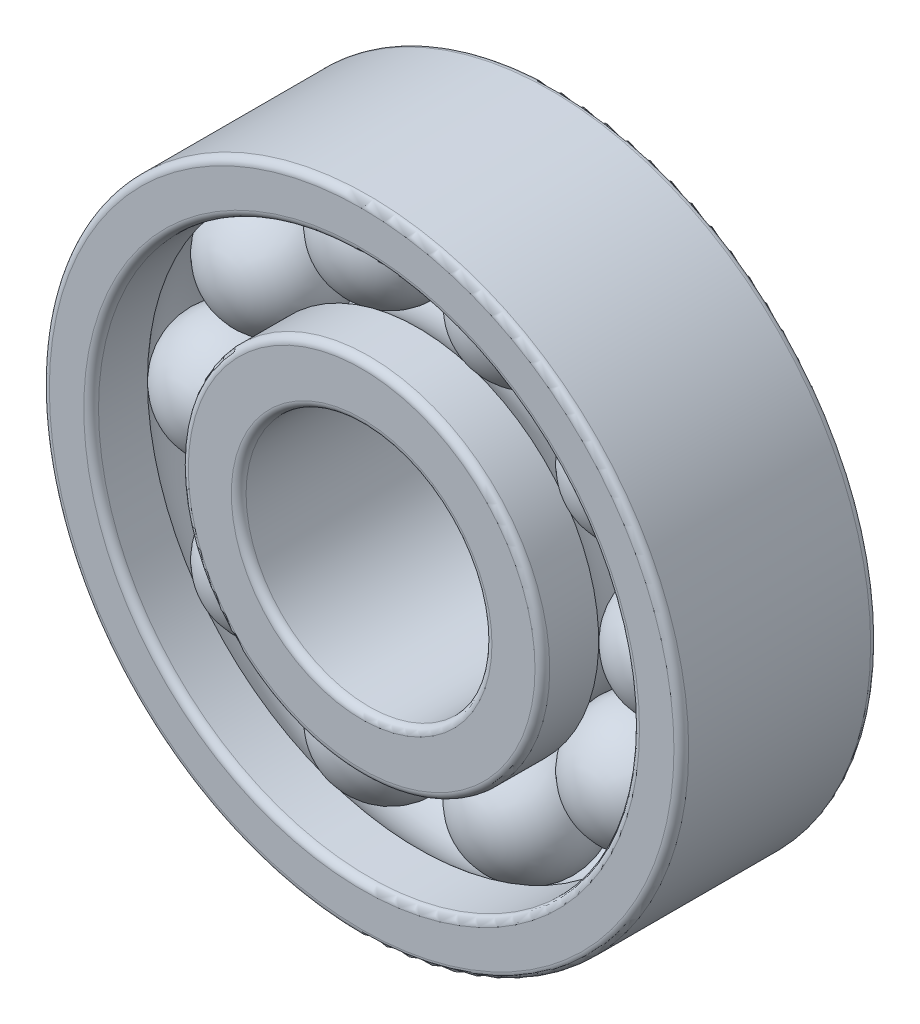
ISO-10303-21;
HEADER;
FILE_DESCRIPTION(('STEP AP214'),'2;1');
FILE_NAME('part.step','',(''),(''),'','','');
FILE_SCHEMA(('AUTOMOTIVE_DESIGN { 1 0 10303 214 1 1 1 1 }'));
ENDSEC;
DATA;
#1=APPLICATION_CONTEXT('core data for automotive mechanical design processes');
#2=APPLICATION_PROTOCOL_DEFINITION('international standard','automotive_design',2000,#1);
#3=PRODUCT_CONTEXT('',#1,'mechanical');
#4=PRODUCT('Part','Part','',(#3));
#5=PRODUCT_RELATED_PRODUCT_CATEGORY('part','',(#4));
#6=PRODUCT_DEFINITION_FORMATION('','',#4);
#7=PRODUCT_DEFINITION_CONTEXT('part definition',#1,'design');
#8=PRODUCT_DEFINITION('design','',#6,#7);
#9=PRODUCT_DEFINITION_SHAPE('','',#8);
#10=(LENGTH_UNIT() NAMED_UNIT(*) SI_UNIT(.MILLI.,.METRE.));
#11=(NAMED_UNIT(*) PLANE_ANGLE_UNIT() SI_UNIT($,.RADIAN.));
#12=(NAMED_UNIT(*) SI_UNIT($,.STERADIAN.) SOLID_ANGLE_UNIT());
#13=UNCERTAINTY_MEASURE_WITH_UNIT(LENGTH_MEASURE(1.E-05),#10,'distance_accuracy_value','');
#14=(GEOMETRIC_REPRESENTATION_CONTEXT(3) GLOBAL_UNCERTAINTY_ASSIGNED_CONTEXT((#13)) GLOBAL_UNIT_ASSIGNED_CONTEXT((#10,
#11,#12)) REPRESENTATION_CONTEXT('',''));
#15=CARTESIAN_POINT('',(0.,0.,0.));
#16=DIRECTION('',(0.,0.,1.));
#17=DIRECTION('',(1.,0.,0.));
#18=AXIS2_PLACEMENT_3D('',#15,#16,#17);
#19=CARTESIAN_POINT('',(-7.42273092339021,5.39292968978334,4.));
#20=DIRECTION('',(0.,0.,-1.));
#21=DIRECTION('',(0.809016994374955,-0.587785252292462,0.));
#22=AXIS2_PLACEMENT_3D('',#19,#20,#21);
#23=SPHERICAL_SURFACE('',#22,2.5);
#24=CARTESIAN_POINT('',(-7.42273092339021,5.39292968978334,1.5));
#25=VERTEX_POINT('',#24);
#26=VERTEX_LOOP('',#25);
#27=FACE_BOUND('',#26,.T.);
#28=ADVANCED_FACE('F73',(#27),#23,.T.);
#29=CLOSED_SHELL('',(#28));
#30=MANIFOLD_SOLID_BREP('B2',#29);
#31=CARTESIAN_POINT('',(-2.83523092339024,8.725943537008,4.));
#32=DIRECTION('',(0.,0.,-1.));
#33=DIRECTION('',(0.309016994374958,-0.95105651629515,0.));
#34=AXIS2_PLACEMENT_3D('',#31,#32,#33);
#35=SPHERICAL_SURFACE('',#34,2.5);
#36=CARTESIAN_POINT('',(-2.83523092339024,8.725943537008,1.5));
#37=VERTEX_POINT('',#36);
#38=VERTEX_LOOP('',#37);
#39=FACE_BOUND('',#38,.T.);
#40=ADVANCED_FACE('F91',(#39),#35,.T.);
#41=CLOSED_SHELL('',(#40));
#42=MANIFOLD_SOLID_BREP('B7',#41);
#43=CARTESIAN_POINT('',(2.83523092339006,8.72594353700806,4.));
#44=DIRECTION('',(0.,0.,-1.));
#45=DIRECTION('',(-0.309016994374938,-0.951056516295157,0.));
#46=AXIS2_PLACEMENT_3D('',#43,#44,#45);
#47=SPHERICAL_SURFACE('',#46,2.5);
#48=CARTESIAN_POINT('',(2.83523092339006,8.72594353700806,1.5));
#49=VERTEX_POINT('',#48);
#50=VERTEX_LOOP('',#49);
#51=FACE_BOUND('',#50,.T.);
#52=ADVANCED_FACE('F109',(#51),#47,.T.);
#53=CLOSED_SHELL('',(#52));
#54=MANIFOLD_SOLID_BREP('B69',#53);
#55=CARTESIAN_POINT('',(7.4227309233901,5.39292968978351,4.));
#56=DIRECTION('',(0.,0.,-1.));
#57=DIRECTION('',(-0.809016994374942,-0.58778525229248,0.));
#58=AXIS2_PLACEMENT_3D('',#55,#56,#57);
#59=SPHERICAL_SURFACE('',#58,2.5);
#60=CARTESIAN_POINT('',(7.4227309233901,5.39292968978351,1.5));
#61=VERTEX_POINT('',#60);
#62=VERTEX_LOOP('',#61);
#63=FACE_BOUND('',#62,.T.);
#64=ADVANCED_FACE('F127',(#63),#59,.T.);
#65=CLOSED_SHELL('',(#64));
#66=MANIFOLD_SOLID_BREP('B87',#65);
#67=CARTESIAN_POINT('',(9.175,0.,4.));
#68=DIRECTION('',(0.,0.,-1.));
#69=DIRECTION('',(-1.,0.,0.));
#70=AXIS2_PLACEMENT_3D('',#67,#68,#69);
#71=SPHERICAL_SURFACE('',#70,2.5);
#72=CARTESIAN_POINT('',(9.175,0.,1.5));
#73=VERTEX_POINT('',#72);
#74=VERTEX_LOOP('',#73);
#75=FACE_BOUND('',#74,.T.);
#76=ADVANCED_FACE('F145',(#75),#71,.T.);
#77=CLOSED_SHELL('',(#76));
#78=MANIFOLD_SOLID_BREP('B105',#77);
#79=CARTESIAN_POINT('',(7.42273092339017,-5.3929296897834,4.));
#80=DIRECTION('',(0.,0.,-1.));
#81=DIRECTION('',(-0.809016994374951,0.587785252292469,0.));
#82=AXIS2_PLACEMENT_3D('',#79,#80,#81);
#83=SPHERICAL_SURFACE('',#82,2.5);
#84=CARTESIAN_POINT('',(7.42273092339017,-5.3929296897834,1.5));
#85=VERTEX_POINT('',#84);
#86=VERTEX_LOOP('',#85);
#87=FACE_BOUND('',#86,.T.);
#88=ADVANCED_FACE('F163',(#87),#83,.T.);
#89=CLOSED_SHELL('',(#88));
#90=MANIFOLD_SOLID_BREP('B123',#89);
#91=CARTESIAN_POINT('',(2.83523092339018,-8.72594353700802,4.));
#92=DIRECTION('',(0.,0.,-1.));
#93=DIRECTION('',(-0.309016994374952,0.951056516295152,0.));
#94=AXIS2_PLACEMENT_3D('',#91,#92,#93);
#95=SPHERICAL_SURFACE('',#94,2.5);
#96=CARTESIAN_POINT('',(2.83523092339018,-8.72594353700802,1.5));
#97=VERTEX_POINT('',#96);
#98=VERTEX_LOOP('',#97);
#99=FACE_BOUND('',#98,.T.);
#100=ADVANCED_FACE('F181',(#99),#95,.T.);
#101=CLOSED_SHELL('',(#100));
#102=MANIFOLD_SOLID_BREP('B141',#101);
#103=CARTESIAN_POINT('',(-2.83523092339012,-8.72594353700804,4.));
#104=DIRECTION('',(0.,0.,-1.));
#105=DIRECTION('',(0.309016994374945,0.951056516295155,0.));
#106=AXIS2_PLACEMENT_3D('',#103,#104,#105);
#107=SPHERICAL_SURFACE('',#106,2.5);
#108=CARTESIAN_POINT('',(-2.83523092339012,-8.72594353700804,1.5));
#109=VERTEX_POINT('',#108);
#110=VERTEX_LOOP('',#109);
#111=FACE_BOUND('',#110,.T.);
#112=ADVANCED_FACE('F199',(#111),#107,.T.);
#113=CLOSED_SHELL('',(#112));
#114=MANIFOLD_SOLID_BREP('B159',#113);
#115=CARTESIAN_POINT('',(-7.42273092339014,-5.39292968978345,4.));
#116=DIRECTION('',(0.,0.,-1.));
#117=DIRECTION('',(0.809016994374947,0.587785252292474,0.));
#118=AXIS2_PLACEMENT_3D('',#115,#116,#117);
#119=SPHERICAL_SURFACE('',#118,2.5);
#120=CARTESIAN_POINT('',(-7.42273092339014,-5.39292968978345,1.5));
#121=VERTEX_POINT('',#120);
#122=VERTEX_LOOP('',#121);
#123=FACE_BOUND('',#122,.T.);
#124=ADVANCED_FACE('F217',(#123),#119,.T.);
#125=CLOSED_SHELL('',(#124));
#126=MANIFOLD_SOLID_BREP('B177',#125);
#127=CARTESIAN_POINT('',(-9.175,0.,4.));
#128=DIRECTION('',(0.,0.,-1.));
#129=DIRECTION('',(1.,0.,0.));
#130=AXIS2_PLACEMENT_3D('',#127,#128,#129);
#131=SPHERICAL_SURFACE('',#130,2.5);
#132=CARTESIAN_POINT('',(-9.175,0.,1.5));
#133=VERTEX_POINT('',#132);
#134=VERTEX_LOOP('',#133);
#135=FACE_BOUND('',#134,.T.);
#136=ADVANCED_FACE('F237',(#135),#131,.T.);
#137=CLOSED_SHELL('',(#136));
#138=MANIFOLD_SOLID_BREP('B195',#137);
#139=CARTESIAN_POINT('',(0.,0.,8.));
#140=DIRECTION('',(0.,0.,-1.));
#141=DIRECTION('',(-1.,0.,0.));
#142=AXIS2_PLACEMENT_3D('',#139,#140,#141);
#143=CYLINDRICAL_SURFACE('',#142,7.35);
#144=CARTESIAN_POINT('',(0.,0.,0.3));
#145=DIRECTION('',(0.,0.,1.));
#146=DIRECTION('',(1.,0.,0.));
#147=AXIS2_PLACEMENT_3D('',#144,#145,#146);
#148=CIRCLE('',#147,7.35);
#149=CARTESIAN_POINT('',(7.35,0.,0.3));
#150=VERTEX_POINT('',#149);
#151=EDGE_CURVE('E236',#150,#150,#148,.T.);
#152=ORIENTED_EDGE('',*,*,#151,.T.);
#153=EDGE_LOOP('',(#152));
#154=FACE_BOUND('',#153,.T.);
#155=CARTESIAN_POINT('',(0.,0.,2.29138213751582));
#156=DIRECTION('',(0.,0.,1.));
#157=DIRECTION('',(1.,0.,0.));
#158=AXIS2_PLACEMENT_3D('',#155,#156,#157);
#159=CIRCLE('',#158,7.35);
#160=CARTESIAN_POINT('',(7.35,0.,2.29138213751582));
#161=VERTEX_POINT('',#160);
#162=EDGE_CURVE('E288',#161,#161,#159,.F.);
#163=ORIENTED_EDGE('',*,*,#162,.T.);
#164=EDGE_LOOP('',(#163));
#165=FACE_BOUND('',#164,.T.);
#166=ADVANCED_FACE('F256',(#154,#165),#143,.T.);
#167=CARTESIAN_POINT('',(0.,0.,8.));
#168=DIRECTION('',(0.,0.,1.));
#169=DIRECTION('',(1.,0.,0.));
#170=AXIS2_PLACEMENT_3D('',#167,#168,#169);
#171=PLANE('',#170);
#172=CARTESIAN_POINT('',(0.,0.,8.));
#173=DIRECTION('',(0.,0.,1.));
#174=DIRECTION('',(1.,0.,0.));
#175=AXIS2_PLACEMENT_3D('',#172,#173,#174);
#176=CIRCLE('',#175,5.3);
#177=CARTESIAN_POINT('',(5.3,0.,8.));
#178=VERTEX_POINT('',#177);
#179=EDGE_CURVE('E276',#178,#178,#176,.F.);
#180=ORIENTED_EDGE('',*,*,#179,.T.);
#181=EDGE_LOOP('',(#180));
#182=FACE_BOUND('',#181,.T.);
#183=CARTESIAN_POINT('',(0.,0.,8.));
#184=DIRECTION('',(0.,0.,1.));
#185=DIRECTION('',(1.,0.,0.));
#186=AXIS2_PLACEMENT_3D('',#183,#184,#185);
#187=CIRCLE('',#186,7.05);
#188=CARTESIAN_POINT('',(7.05,0.,8.));
#189=VERTEX_POINT('',#188);
#190=EDGE_CURVE('E279',#189,#189,#187,.T.);
#191=ORIENTED_EDGE('',*,*,#190,.T.);
#192=EDGE_LOOP('',(#191));
#193=FACE_BOUND('',#192,.T.);
#194=ADVANCED_FACE('F306',(#182,#193),#171,.T.);
#195=CARTESIAN_POINT('',(0.,0.,0.));
#196=DIRECTION('',(0.,0.,1.));
#197=DIRECTION('',(1.,0.,0.));
#198=AXIS2_PLACEMENT_3D('',#195,#196,#197);
#199=PLANE('',#198);
#200=CARTESIAN_POINT('',(0.,0.,0.));
#201=DIRECTION('',(0.,0.,1.));
#202=DIRECTION('',(1.,0.,0.));
#203=AXIS2_PLACEMENT_3D('',#200,#201,#202);
#204=CIRCLE('',#203,5.3);
#205=CARTESIAN_POINT('',(5.3,0.,0.));
#206=VERTEX_POINT('',#205);
#207=EDGE_CURVE('E263',#206,#206,#204,.T.);
#208=ORIENTED_EDGE('',*,*,#207,.T.);
#209=EDGE_LOOP('',(#208));
#210=FACE_BOUND('',#209,.T.);
#211=CARTESIAN_POINT('',(0.,0.,0.));
#212=DIRECTION('',(0.,0.,1.));
#213=DIRECTION('',(1.,0.,0.));
#214=AXIS2_PLACEMENT_3D('',#211,#212,#213);
#215=CIRCLE('',#214,7.05);
#216=CARTESIAN_POINT('',(7.05,0.,0.));
#217=VERTEX_POINT('',#216);
#218=EDGE_CURVE('E267',#217,#217,#215,.F.);
#219=ORIENTED_EDGE('',*,*,#218,.T.);
#220=EDGE_LOOP('',(#219));
#221=FACE_BOUND('',#220,.T.);
#222=ADVANCED_FACE('F311',(#210,#221),#199,.F.);
#223=CARTESIAN_POINT('',(0.,0.,7.7));
#224=DIRECTION('',(0.,0.,1.));
#225=DIRECTION('',(1.,0.,0.));
#226=AXIS2_PLACEMENT_3D('',#223,#224,#225);
#227=CIRCLE('',#226,7.35);
#228=CARTESIAN_POINT('',(7.35,0.,7.7));
#229=VERTEX_POINT('',#228);
#230=EDGE_CURVE('E271',#229,#229,#227,.F.);
#231=ORIENTED_EDGE('',*,*,#230,.T.);
#232=EDGE_LOOP('',(#231));
#233=FACE_BOUND('',#232,.T.);
#234=CARTESIAN_POINT('',(0.,0.,5.70861786248418));
#235=DIRECTION('',(0.,0.,-1.));
#236=DIRECTION('',(-1.,0.,0.));
#237=AXIS2_PLACEMENT_3D('',#234,#235,#236);
#238=CIRCLE('',#237,7.35);
#239=CARTESIAN_POINT('',(-7.35,0.,5.70861786248418));
#240=VERTEX_POINT('',#239);
#241=EDGE_CURVE('E291',#240,#240,#238,.F.);
#242=ORIENTED_EDGE('',*,*,#241,.T.);
#243=EDGE_LOOP('',(#242));
#244=FACE_BOUND('',#243,.T.);
#245=ADVANCED_FACE('F295',(#233,#244),#143,.T.);
#246=CARTESIAN_POINT('',(0.,0.,8.));
#247=DIRECTION('',(0.,0.,-1.));
#248=DIRECTION('',(-1.,0.,0.));
#249=AXIS2_PLACEMENT_3D('',#246,#247,#248);
#250=CYLINDRICAL_SURFACE('',#249,5.);
#251=CARTESIAN_POINT('',(0.,0.,7.7));
#252=DIRECTION('',(0.,0.,1.));
#253=DIRECTION('',(1.,0.,0.));
#254=AXIS2_PLACEMENT_3D('',#251,#252,#253);
#255=CIRCLE('',#254,5.);
#256=CARTESIAN_POINT('',(5.,0.,7.7));
#257=VERTEX_POINT('',#256);
#258=EDGE_CURVE('E282',#257,#257,#255,.T.);
#259=ORIENTED_EDGE('',*,*,#258,.T.);
#260=EDGE_LOOP('',(#259));
#261=FACE_BOUND('',#260,.T.);
#262=CARTESIAN_POINT('',(0.,0.,0.3));
#263=DIRECTION('',(0.,0.,1.));
#264=DIRECTION('',(1.,0.,0.));
#265=AXIS2_PLACEMENT_3D('',#262,#263,#264);
#266=CIRCLE('',#265,5.);
#267=CARTESIAN_POINT('',(5.,0.,0.3));
#268=VERTEX_POINT('',#267);
#269=EDGE_CURVE('E285',#268,#268,#266,.F.);
#270=ORIENTED_EDGE('',*,*,#269,.T.);
#271=EDGE_LOOP('',(#270));
#272=FACE_BOUND('',#271,.T.);
#273=ADVANCED_FACE('F301',(#261,#272),#250,.F.);
#274=CARTESIAN_POINT('',(0.,0.,4.));
#275=DIRECTION('',(0.,0.,-1.));
#276=DIRECTION('',(-1.,0.,0.));
#277=AXIS2_PLACEMENT_3D('',#274,#275,#276);
#278=TOROIDAL_SURFACE('',#277,9.175,2.5);
#279=ORIENTED_EDGE('',*,*,#241,.F.);
#280=EDGE_LOOP('',(#279));
#281=FACE_BOUND('',#280,.T.);
#282=ORIENTED_EDGE('',*,*,#162,.F.);
#283=EDGE_LOOP('',(#282));
#284=FACE_BOUND('',#283,.T.);
#285=ADVANCED_FACE('F297',(#281,#284),#278,.F.);
#286=CARTESIAN_POINT('',(0.,0.,7.7));
#287=DIRECTION('',(0.,0.,1.));
#288=DIRECTION('',(1.,0.,0.));
#289=AXIS2_PLACEMENT_3D('',#286,#287,#288);
#290=TOROIDAL_SURFACE('',#289,5.3,0.3);
#291=ORIENTED_EDGE('',*,*,#179,.F.);
#292=EDGE_LOOP('',(#291));
#293=FACE_BOUND('',#292,.T.);
#294=ORIENTED_EDGE('',*,*,#258,.F.);
#295=EDGE_LOOP('',(#294));
#296=FACE_BOUND('',#295,.T.);
#297=ADVANCED_FACE('F300',(#293,#296),#290,.T.);
#298=CARTESIAN_POINT('',(0.,0.,7.7));
#299=DIRECTION('',(0.,0.,1.));
#300=DIRECTION('',(1.,0.,0.));
#301=AXIS2_PLACEMENT_3D('',#298,#299,#300);
#302=TOROIDAL_SURFACE('',#301,7.05,0.3);
#303=ORIENTED_EDGE('',*,*,#230,.F.);
#304=EDGE_LOOP('',(#303));
#305=FACE_BOUND('',#304,.T.);
#306=ORIENTED_EDGE('',*,*,#190,.F.);
#307=EDGE_LOOP('',(#306));
#308=FACE_BOUND('',#307,.T.);
#309=ADVANCED_FACE('F325',(#305,#308),#302,.T.);
#310=CARTESIAN_POINT('',(0.,0.,0.3));
#311=DIRECTION('',(0.,0.,1.));
#312=DIRECTION('',(1.,0.,0.));
#313=AXIS2_PLACEMENT_3D('',#310,#311,#312);
#314=TOROIDAL_SURFACE('',#313,5.3,0.3);
#315=ORIENTED_EDGE('',*,*,#269,.F.);
#316=EDGE_LOOP('',(#315));
#317=FACE_BOUND('',#316,.T.);
#318=ORIENTED_EDGE('',*,*,#207,.F.);
#319=EDGE_LOOP('',(#318));
#320=FACE_BOUND('',#319,.T.);
#321=ADVANCED_FACE('F328',(#317,#320),#314,.T.);
#322=CARTESIAN_POINT('',(0.,0.,0.3));
#323=DIRECTION('',(0.,0.,1.));
#324=DIRECTION('',(1.,0.,0.));
#325=AXIS2_PLACEMENT_3D('',#322,#323,#324);
#326=TOROIDAL_SURFACE('',#325,7.05,0.3);
#327=ORIENTED_EDGE('',*,*,#218,.F.);
#328=EDGE_LOOP('',(#327));
#329=FACE_BOUND('',#328,.T.);
#330=ORIENTED_EDGE('',*,*,#151,.F.);
#331=EDGE_LOOP('',(#330));
#332=FACE_BOUND('',#331,.T.);
#333=ADVANCED_FACE('F258',(#329,#332),#326,.T.);
#334=CLOSED_SHELL('',(#166,#194,#222,#245,#273,#285,#297,#309,#321,#333));
#335=MANIFOLD_SOLID_BREP('B213',#334);
#336=CARTESIAN_POINT('',(0.,0.,8.));
#337=DIRECTION('',(0.,0.,-1.));
#338=DIRECTION('',(-1.,0.,0.));
#339=AXIS2_PLACEMENT_3D('',#336,#337,#338);
#340=CYLINDRICAL_SURFACE('',#339,11.);
#341=CARTESIAN_POINT('',(0.,0.,0.3));
#342=DIRECTION('',(0.,0.,1.));
#343=DIRECTION('',(1.,0.,0.));
#344=AXIS2_PLACEMENT_3D('',#341,#342,#343);
#345=CIRCLE('',#344,11.);
#346=CARTESIAN_POINT('',(11.,0.,0.3));
#347=VERTEX_POINT('',#346);
#348=EDGE_CURVE('E429',#347,#347,#345,.F.);
#349=ORIENTED_EDGE('',*,*,#348,.T.);
#350=EDGE_LOOP('',(#349));
#351=FACE_BOUND('',#350,.T.);
#352=CARTESIAN_POINT('',(0.,0.,2.29138213751582));
#353=DIRECTION('',(0.,0.,1.));
#354=DIRECTION('',(1.,0.,0.));
#355=AXIS2_PLACEMENT_3D('',#352,#353,#354);
#356=CIRCLE('',#355,11.);
#357=CARTESIAN_POINT('',(11.,0.,2.29138213751582));
#358=VERTEX_POINT('',#357);
#359=EDGE_CURVE('E438',#358,#358,#356,.F.);
#360=ORIENTED_EDGE('',*,*,#359,.F.);
#361=EDGE_LOOP('',(#360));
#362=FACE_BOUND('',#361,.T.);
#363=ADVANCED_FACE('F406',(#351,#362),#340,.F.);
#364=CARTESIAN_POINT('',(0.,0.,8.));
#365=DIRECTION('',(0.,0.,1.));
#366=DIRECTION('',(1.,0.,0.));
#367=AXIS2_PLACEMENT_3D('',#364,#365,#366);
#368=PLANE('',#367);
#369=CARTESIAN_POINT('',(0.,0.,8.));
#370=DIRECTION('',(0.,0.,1.));
#371=DIRECTION('',(1.,0.,0.));
#372=AXIS2_PLACEMENT_3D('',#369,#370,#371);
#373=CIRCLE('',#372,11.3);
#374=CARTESIAN_POINT('',(11.3,0.,8.));
#375=VERTEX_POINT('',#374);
#376=EDGE_CURVE('E255',#375,#375,#373,.F.);
#377=ORIENTED_EDGE('',*,*,#376,.T.);
#378=EDGE_LOOP('',(#377));
#379=FACE_BOUND('',#378,.T.);
#380=CARTESIAN_POINT('',(0.,0.,8.));
#381=DIRECTION('',(0.,0.,1.));
#382=DIRECTION('',(1.,0.,0.));
#383=AXIS2_PLACEMENT_3D('',#380,#381,#382);
#384=CIRCLE('',#383,12.7);
#385=CARTESIAN_POINT('',(12.7,0.,8.));
#386=VERTEX_POINT('',#385);
#387=EDGE_CURVE('E413',#386,#386,#384,.T.);
#388=ORIENTED_EDGE('',*,*,#387,.T.);
#389=EDGE_LOOP('',(#388));
#390=FACE_BOUND('',#389,.T.);
#391=ADVANCED_FACE('F464',(#379,#390),#368,.T.);
#392=CARTESIAN_POINT('',(0.,0.,0.));
#393=DIRECTION('',(0.,0.,1.));
#394=DIRECTION('',(1.,0.,0.));
#395=AXIS2_PLACEMENT_3D('',#392,#393,#394);
#396=PLANE('',#395);
#397=CARTESIAN_POINT('',(0.,0.,0.));
#398=DIRECTION('',(0.,0.,1.));
#399=DIRECTION('',(1.,0.,0.));
#400=AXIS2_PLACEMENT_3D('',#397,#398,#399);
#401=CIRCLE('',#400,11.3);
#402=CARTESIAN_POINT('',(11.3,0.,0.));
#403=VERTEX_POINT('',#402);
#404=EDGE_CURVE('E432',#403,#403,#401,.T.);
#405=ORIENTED_EDGE('',*,*,#404,.T.);
#406=EDGE_LOOP('',(#405));
#407=FACE_BOUND('',#406,.T.);
#408=CARTESIAN_POINT('',(0.,0.,0.));
#409=DIRECTION('',(0.,0.,1.));
#410=DIRECTION('',(1.,0.,0.));
#411=AXIS2_PLACEMENT_3D('',#408,#409,#410);
#412=CIRCLE('',#411,12.7);
#413=CARTESIAN_POINT('',(12.7,0.,0.));
#414=VERTEX_POINT('',#413);
#415=EDGE_CURVE('E435',#414,#414,#412,.F.);
#416=ORIENTED_EDGE('',*,*,#415,.T.);
#417=EDGE_LOOP('',(#416));
#418=FACE_BOUND('',#417,.T.);
#419=ADVANCED_FACE('F459',(#407,#418),#396,.F.);
#420=CARTESIAN_POINT('',(0.,0.,8.));
#421=DIRECTION('',(0.,0.,-1.));
#422=DIRECTION('',(-1.,0.,0.));
#423=AXIS2_PLACEMENT_3D('',#420,#421,#422);
#424=CYLINDRICAL_SURFACE('',#423,13.);
#425=CARTESIAN_POINT('',(0.,0.,0.3));
#426=DIRECTION('',(0.,0.,1.));
#427=DIRECTION('',(1.,0.,0.));
#428=AXIS2_PLACEMENT_3D('',#425,#426,#427);
#429=CIRCLE('',#428,13.);
#430=CARTESIAN_POINT('',(13.,0.,0.3));
#431=VERTEX_POINT('',#430);
#432=EDGE_CURVE('E421',#431,#431,#429,.T.);
#433=ORIENTED_EDGE('',*,*,#432,.T.);
#434=EDGE_LOOP('',(#433));
#435=FACE_BOUND('',#434,.T.);
#436=CARTESIAN_POINT('',(0.,0.,7.7));
#437=DIRECTION('',(0.,0.,1.));
#438=DIRECTION('',(1.,0.,0.));
#439=AXIS2_PLACEMENT_3D('',#436,#437,#438);
#440=CIRCLE('',#439,13.);
#441=CARTESIAN_POINT('',(13.,0.,7.7));
#442=VERTEX_POINT('',#441);
#443=EDGE_CURVE('E426',#442,#442,#440,.F.);
#444=ORIENTED_EDGE('',*,*,#443,.T.);
#445=EDGE_LOOP('',(#444));
#446=FACE_BOUND('',#445,.T.);
#447=ADVANCED_FACE('F449',(#435,#446),#424,.T.);
#448=CARTESIAN_POINT('',(0.,0.,7.7));
#449=DIRECTION('',(0.,0.,1.));
#450=DIRECTION('',(1.,0.,0.));
#451=AXIS2_PLACEMENT_3D('',#448,#449,#450);
#452=CIRCLE('',#451,11.);
#453=CARTESIAN_POINT('',(11.,0.,7.7));
#454=VERTEX_POINT('',#453);
#455=EDGE_CURVE('E417',#454,#454,#452,.T.);
#456=ORIENTED_EDGE('',*,*,#455,.T.);
#457=EDGE_LOOP('',(#456));
#458=FACE_BOUND('',#457,.T.);
#459=CARTESIAN_POINT('',(0.,0.,5.70861786248418));
#460=DIRECTION('',(0.,0.,-1.));
#461=DIRECTION('',(-1.,0.,0.));
#462=AXIS2_PLACEMENT_3D('',#459,#460,#461);
#463=CIRCLE('',#462,11.);
#464=CARTESIAN_POINT('',(-11.,0.,5.70861786248418));
#465=VERTEX_POINT('',#464);
#466=EDGE_CURVE('E441',#465,#465,#463,.F.);
#467=ORIENTED_EDGE('',*,*,#466,.F.);
#468=EDGE_LOOP('',(#467));
#469=FACE_BOUND('',#468,.T.);
#470=ADVANCED_FACE('F447',(#458,#469),#340,.F.);
#471=CARTESIAN_POINT('',(0.,0.,4.));
#472=DIRECTION('',(0.,0.,-1.));
#473=DIRECTION('',(-1.,0.,0.));
#474=AXIS2_PLACEMENT_3D('',#471,#472,#473);
#475=TOROIDAL_SURFACE('',#474,9.175,2.5);
#476=ORIENTED_EDGE('',*,*,#359,.T.);
#477=EDGE_LOOP('',(#476));
#478=FACE_BOUND('',#477,.T.);
#479=ORIENTED_EDGE('',*,*,#466,.T.);
#480=EDGE_LOOP('',(#479));
#481=FACE_BOUND('',#480,.T.);
#482=ADVANCED_FACE('F445',(#478,#481),#475,.F.);
#483=CARTESIAN_POINT('',(0.,0.,0.3));
#484=DIRECTION('',(0.,0.,1.));
#485=DIRECTION('',(1.,0.,0.));
#486=AXIS2_PLACEMENT_3D('',#483,#484,#485);
#487=TOROIDAL_SURFACE('',#486,11.3,0.3);
#488=ORIENTED_EDGE('',*,*,#348,.F.);
#489=EDGE_LOOP('',(#488));
#490=FACE_BOUND('',#489,.T.);
#491=ORIENTED_EDGE('',*,*,#404,.F.);
#492=EDGE_LOOP('',(#491));
#493=FACE_BOUND('',#492,.T.);
#494=ADVANCED_FACE('F456',(#490,#493),#487,.T.);
#495=CARTESIAN_POINT('',(0.,0.,0.3));
#496=DIRECTION('',(0.,0.,1.));
#497=DIRECTION('',(1.,0.,0.));
#498=AXIS2_PLACEMENT_3D('',#495,#496,#497);
#499=TOROIDAL_SURFACE('',#498,12.7,0.3);
#500=ORIENTED_EDGE('',*,*,#415,.F.);
#501=EDGE_LOOP('',(#500));
#502=FACE_BOUND('',#501,.T.);
#503=ORIENTED_EDGE('',*,*,#432,.F.);
#504=EDGE_LOOP('',(#503));
#505=FACE_BOUND('',#504,.T.);
#506=ADVANCED_FACE('F475',(#502,#505),#499,.T.);
#507=CARTESIAN_POINT('',(0.,0.,7.7));
#508=DIRECTION('',(0.,0.,1.));
#509=DIRECTION('',(1.,0.,0.));
#510=AXIS2_PLACEMENT_3D('',#507,#508,#509);
#511=TOROIDAL_SURFACE('',#510,11.3,0.3);
#512=ORIENTED_EDGE('',*,*,#376,.F.);
#513=EDGE_LOOP('',(#512));
#514=FACE_BOUND('',#513,.T.);
#515=ORIENTED_EDGE('',*,*,#455,.F.);
#516=EDGE_LOOP('',(#515));
#517=FACE_BOUND('',#516,.T.);
#518=ADVANCED_FACE('F486',(#514,#517),#511,.T.);
#519=CARTESIAN_POINT('',(0.,0.,7.7));
#520=DIRECTION('',(0.,0.,1.));
#521=DIRECTION('',(1.,0.,0.));
#522=AXIS2_PLACEMENT_3D('',#519,#520,#521);
#523=TOROIDAL_SURFACE('',#522,12.7,0.3);
#524=ORIENTED_EDGE('',*,*,#443,.F.);
#525=EDGE_LOOP('',(#524));
#526=FACE_BOUND('',#525,.T.);
#527=ORIENTED_EDGE('',*,*,#387,.F.);
#528=EDGE_LOOP('',(#527));
#529=FACE_BOUND('',#528,.T.);
#530=ADVANCED_FACE('F408',(#526,#529),#523,.T.);
#531=CLOSED_SHELL('',(#363,#391,#419,#447,#470,#482,#494,#506,#518,#530));
#532=MANIFOLD_SOLID_BREP('B231',#531);
#533=ADVANCED_BREP_SHAPE_REPRESENTATION('',(#18,#30,#42,#54,#66,#78,#90,#102,#114,#126,#138,
#335,#532),#14);
#534=SHAPE_DEFINITION_REPRESENTATION(#9,#533);
ENDSEC;
END-ISO-10303-21;
